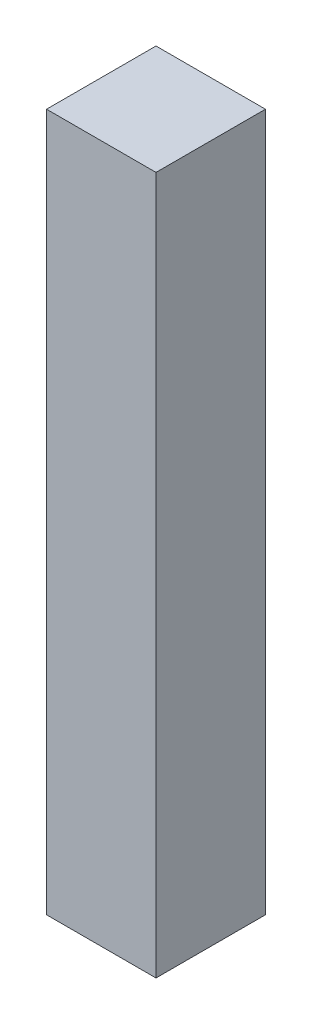
ISO-10303-21;
HEADER;
FILE_DESCRIPTION(('STEP AP214'),'2;1');
FILE_NAME('part.step','',(''),(''),'','','');
FILE_SCHEMA(('AUTOMOTIVE_DESIGN { 1 0 10303 214 1 1 1 1 }'));
ENDSEC;
DATA;
#1=APPLICATION_CONTEXT('core data for automotive mechanical design processes');
#2=APPLICATION_PROTOCOL_DEFINITION('international standard','automotive_design',2000,#1);
#3=PRODUCT_CONTEXT('',#1,'mechanical');
#4=PRODUCT('Part','Part','',(#3));
#5=PRODUCT_RELATED_PRODUCT_CATEGORY('part','',(#4));
#6=PRODUCT_DEFINITION_FORMATION('','',#4);
#7=PRODUCT_DEFINITION_CONTEXT('part definition',#1,'design');
#8=PRODUCT_DEFINITION('design','',#6,#7);
#9=PRODUCT_DEFINITION_SHAPE('','',#8);
#10=(LENGTH_UNIT() NAMED_UNIT(*) SI_UNIT(.MILLI.,.METRE.));
#11=(NAMED_UNIT(*) PLANE_ANGLE_UNIT() SI_UNIT($,.RADIAN.));
#12=(NAMED_UNIT(*) SI_UNIT($,.STERADIAN.) SOLID_ANGLE_UNIT());
#13=UNCERTAINTY_MEASURE_WITH_UNIT(LENGTH_MEASURE(1.E-05),#10,'distance_accuracy_value','');
#14=(GEOMETRIC_REPRESENTATION_CONTEXT(3) GLOBAL_UNCERTAINTY_ASSIGNED_CONTEXT((#13)) GLOBAL_UNIT_ASSIGNED_CONTEXT((#10,
#11,#12)) REPRESENTATION_CONTEXT('',''));
#15=CARTESIAN_POINT('',(0.,0.,0.));
#16=DIRECTION('',(0.,0.,1.));
#17=DIRECTION('',(1.,0.,0.));
#18=AXIS2_PLACEMENT_3D('',#15,#16,#17);
#19=CARTESIAN_POINT('',(12.7,161.9,12.7));
#20=DIRECTION('',(-1.,0.,0.));
#21=DIRECTION('',(0.,0.,1.));
#22=AXIS2_PLACEMENT_3D('',#19,#20,#21);
#23=PLANE('',#22);
#24=DIRECTION('',(0.,0.,-1.));
#25=VECTOR('',#24,1.);
#26=CARTESIAN_POINT('',(12.7,0.,12.7));
#27=LINE('',#26,#25);
#28=CARTESIAN_POINT('',(12.7,0.,12.7));
#29=VERTEX_POINT('',#28);
#30=CARTESIAN_POINT('',(12.7,0.,-12.7));
#31=VERTEX_POINT('',#30);
#32=EDGE_CURVE('E99',#29,#31,#27,.T.);
#33=ORIENTED_EDGE('',*,*,#32,.T.);
#34=DIRECTION('',(0.,-1.,0.));
#35=VECTOR('',#34,1.);
#36=CARTESIAN_POINT('',(12.7,161.9,-12.7));
#37=LINE('',#36,#35);
#38=CARTESIAN_POINT('',(12.7,161.9,-12.7));
#39=VERTEX_POINT('',#38);
#40=EDGE_CURVE('E11',#39,#31,#37,.T.);
#41=ORIENTED_EDGE('',*,*,#40,.F.);
#42=DIRECTION('',(0.,0.,-1.));
#43=VECTOR('',#42,1.);
#44=CARTESIAN_POINT('',(12.7,161.9,12.7));
#45=LINE('',#44,#43);
#46=CARTESIAN_POINT('',(12.7,161.9,12.7));
#47=VERTEX_POINT('',#46);
#48=EDGE_CURVE('E87',#47,#39,#45,.T.);
#49=ORIENTED_EDGE('',*,*,#48,.F.);
#50=DIRECTION('',(0.,-1.,0.));
#51=VECTOR('',#50,1.);
#52=CARTESIAN_POINT('',(12.7,161.9,12.7));
#53=LINE('',#52,#51);
#54=EDGE_CURVE('E95',#47,#29,#53,.T.);
#55=ORIENTED_EDGE('',*,*,#54,.T.);
#56=EDGE_LOOP('',(#33,#41,#49,#55));
#57=FACE_BOUND('',#56,.T.);
#58=ADVANCED_FACE('F36',(#57),#23,.F.);
#59=CARTESIAN_POINT('',(-12.7,161.9,-12.7));
#60=DIRECTION('',(0.,0.,1.));
#61=DIRECTION('',(1.,0.,0.));
#62=AXIS2_PLACEMENT_3D('',#59,#60,#61);
#63=PLANE('',#62);
#64=DIRECTION('',(-1.,0.,0.));
#65=VECTOR('',#64,1.);
#66=CARTESIAN_POINT('',(-12.7,0.,-12.7));
#67=LINE('',#66,#65);
#68=CARTESIAN_POINT('',(-12.7,0.,-12.7));
#69=VERTEX_POINT('',#68);
#70=EDGE_CURVE('E91',#31,#69,#67,.T.);
#71=ORIENTED_EDGE('',*,*,#70,.T.);
#72=DIRECTION('',(0.,-1.,0.));
#73=VECTOR('',#72,1.);
#74=CARTESIAN_POINT('',(-12.7,161.9,-12.7));
#75=LINE('',#74,#73);
#76=CARTESIAN_POINT('',(-12.7,161.9,-12.7));
#77=VERTEX_POINT('',#76);
#78=EDGE_CURVE('E44',#77,#69,#75,.T.);
#79=ORIENTED_EDGE('',*,*,#78,.F.);
#80=DIRECTION('',(-1.,0.,0.));
#81=VECTOR('',#80,1.);
#82=CARTESIAN_POINT('',(-12.7,161.9,-12.7));
#83=LINE('',#82,#81);
#84=EDGE_CURVE('E82',#39,#77,#83,.T.);
#85=ORIENTED_EDGE('',*,*,#84,.F.);
#86=ORIENTED_EDGE('',*,*,#40,.T.);
#87=EDGE_LOOP('',(#71,#79,#85,#86));
#88=FACE_BOUND('',#87,.T.);
#89=ADVANCED_FACE('F90',(#88),#63,.F.);
#90=CARTESIAN_POINT('',(-12.7,161.9,12.7));
#91=DIRECTION('',(1.,0.,0.));
#92=DIRECTION('',(0.,0.,-1.));
#93=AXIS2_PLACEMENT_3D('',#90,#91,#92);
#94=PLANE('',#93);
#95=DIRECTION('',(0.,0.,1.));
#96=VECTOR('',#95,1.);
#97=CARTESIAN_POINT('',(-12.7,0.,12.7));
#98=LINE('',#97,#96);
#99=CARTESIAN_POINT('',(-12.7,0.,12.7));
#100=VERTEX_POINT('',#99);
#101=EDGE_CURVE('E69',#69,#100,#98,.T.);
#102=ORIENTED_EDGE('',*,*,#101,.T.);
#103=DIRECTION('',(0.,-1.,0.));
#104=VECTOR('',#103,1.);
#105=CARTESIAN_POINT('',(-12.7,161.9,12.7));
#106=LINE('',#105,#104);
#107=CARTESIAN_POINT('',(-12.7,161.9,12.7));
#108=VERTEX_POINT('',#107);
#109=EDGE_CURVE('E92',#108,#100,#106,.T.);
#110=ORIENTED_EDGE('',*,*,#109,.F.);
#111=DIRECTION('',(0.,0.,1.));
#112=VECTOR('',#111,1.);
#113=CARTESIAN_POINT('',(-12.7,161.9,12.7));
#114=LINE('',#113,#112);
#115=EDGE_CURVE('E85',#77,#108,#114,.T.);
#116=ORIENTED_EDGE('',*,*,#115,.F.);
#117=ORIENTED_EDGE('',*,*,#78,.T.);
#118=EDGE_LOOP('',(#102,#110,#116,#117));
#119=FACE_BOUND('',#118,.T.);
#120=ADVANCED_FACE('F93',(#119),#94,.F.);
#121=CARTESIAN_POINT('',(-12.7,161.9,12.7));
#122=DIRECTION('',(0.,0.,-1.));
#123=DIRECTION('',(-1.,0.,0.));
#124=AXIS2_PLACEMENT_3D('',#121,#122,#123);
#125=PLANE('',#124);
#126=DIRECTION('',(1.,0.,0.));
#127=VECTOR('',#126,1.);
#128=CARTESIAN_POINT('',(-12.7,0.,12.7));
#129=LINE('',#128,#127);
#130=EDGE_CURVE('E75',#100,#29,#129,.T.);
#131=ORIENTED_EDGE('',*,*,#130,.T.);
#132=ORIENTED_EDGE('',*,*,#54,.F.);
#133=DIRECTION('',(1.,0.,0.));
#134=VECTOR('',#133,1.);
#135=CARTESIAN_POINT('',(-12.7,161.9,12.7));
#136=LINE('',#135,#134);
#137=EDGE_CURVE('E52',#108,#47,#136,.T.);
#138=ORIENTED_EDGE('',*,*,#137,.F.);
#139=ORIENTED_EDGE('',*,*,#109,.T.);
#140=EDGE_LOOP('',(#131,#132,#138,#139));
#141=FACE_BOUND('',#140,.T.);
#142=ADVANCED_FACE('F106',(#141),#125,.F.);
#143=CARTESIAN_POINT('',(0.,161.9,0.));
#144=DIRECTION('',(0.,-1.,0.));
#145=DIRECTION('',(0.,0.,-1.));
#146=AXIS2_PLACEMENT_3D('',#143,#144,#145);
#147=PLANE('',#146);
#148=ORIENTED_EDGE('',*,*,#48,.T.);
#149=ORIENTED_EDGE('',*,*,#84,.T.);
#150=ORIENTED_EDGE('',*,*,#115,.T.);
#151=ORIENTED_EDGE('',*,*,#137,.T.);
#152=EDGE_LOOP('',(#148,#149,#150,#151));
#153=FACE_BOUND('',#152,.T.);
#154=ADVANCED_FACE('F83',(#153),#147,.F.);
#155=CARTESIAN_POINT('',(0.,0.,0.));
#156=DIRECTION('',(0.,-1.,0.));
#157=DIRECTION('',(0.,0.,-1.));
#158=AXIS2_PLACEMENT_3D('',#155,#156,#157);
#159=PLANE('',#158);
#160=ORIENTED_EDGE('',*,*,#32,.F.);
#161=ORIENTED_EDGE('',*,*,#130,.F.);
#162=ORIENTED_EDGE('',*,*,#101,.F.);
#163=ORIENTED_EDGE('',*,*,#70,.F.);
#164=EDGE_LOOP('',(#160,#161,#162,#163));
#165=FACE_BOUND('',#164,.T.);
#166=ADVANCED_FACE('F109',(#165),#159,.T.);
#167=CLOSED_SHELL('',(#58,#89,#120,#142,#154,#166));
#168=MANIFOLD_SOLID_BREP('B2',#167);
#169=ADVANCED_BREP_SHAPE_REPRESENTATION('',(#18,#168),#14);
#170=SHAPE_DEFINITION_REPRESENTATION(#9,#169);
ENDSEC;
END-ISO-10303-21;
